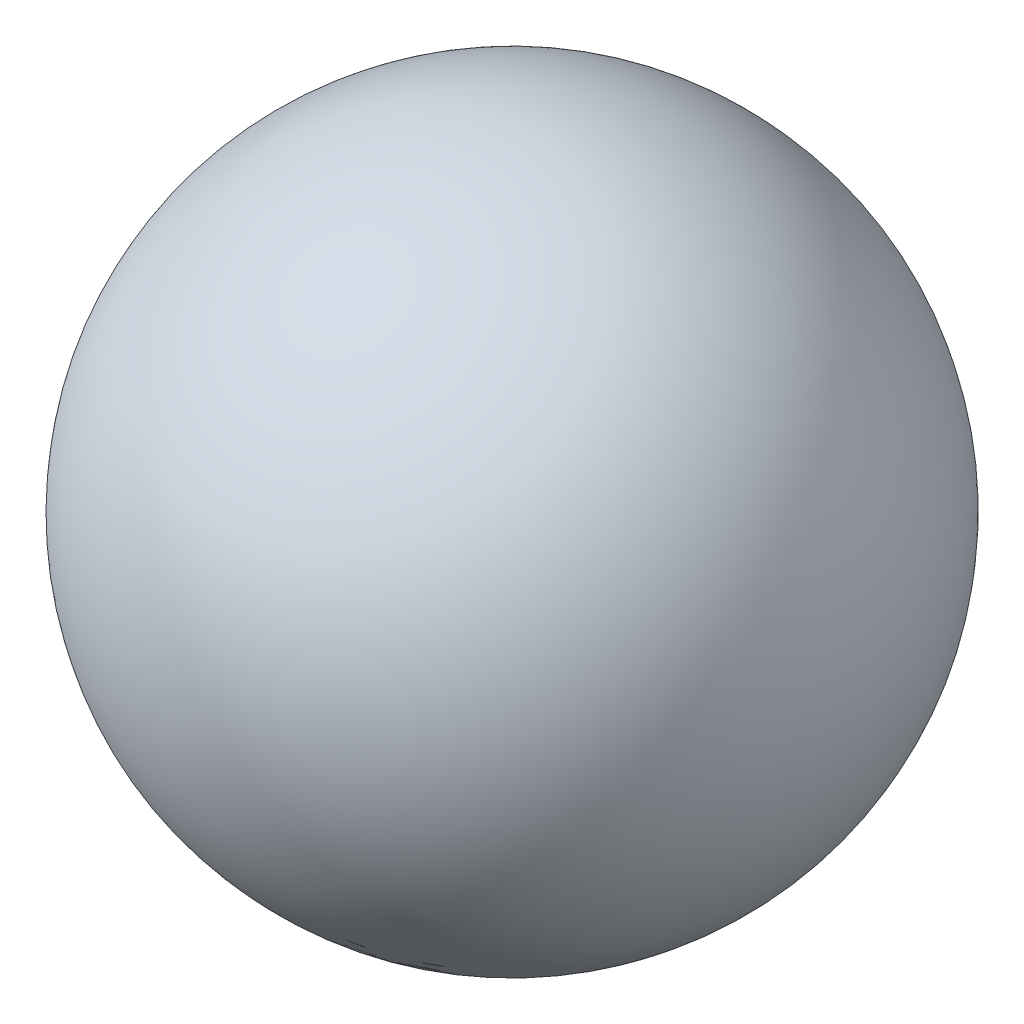
ISO-10303-21;
HEADER;
FILE_DESCRIPTION(('STEP AP214'),'2;1');
FILE_NAME('part.step','',(''),(''),'','','');
FILE_SCHEMA(('AUTOMOTIVE_DESIGN { 1 0 10303 214 1 1 1 1 }'));
ENDSEC;
DATA;
#1=APPLICATION_CONTEXT('core data for automotive mechanical design processes');
#2=APPLICATION_PROTOCOL_DEFINITION('international standard','automotive_design',2000,#1);
#3=PRODUCT_CONTEXT('',#1,'mechanical');
#4=PRODUCT('Part','Part','',(#3));
#5=PRODUCT_RELATED_PRODUCT_CATEGORY('part','',(#4));
#6=PRODUCT_DEFINITION_FORMATION('','',#4);
#7=PRODUCT_DEFINITION_CONTEXT('part definition',#1,'design');
#8=PRODUCT_DEFINITION('design','',#6,#7);
#9=PRODUCT_DEFINITION_SHAPE('','',#8);
#10=(LENGTH_UNIT() NAMED_UNIT(*) SI_UNIT(.MILLI.,.METRE.));
#11=(NAMED_UNIT(*) PLANE_ANGLE_UNIT() SI_UNIT($,.RADIAN.));
#12=(NAMED_UNIT(*) SI_UNIT($,.STERADIAN.) SOLID_ANGLE_UNIT());
#13=UNCERTAINTY_MEASURE_WITH_UNIT(LENGTH_MEASURE(1.E-05),#10,'distance_accuracy_value','');
#14=(GEOMETRIC_REPRESENTATION_CONTEXT(3) GLOBAL_UNCERTAINTY_ASSIGNED_CONTEXT((#13)) GLOBAL_UNIT_ASSIGNED_CONTEXT((#10,
#11,#12)) REPRESENTATION_CONTEXT('',''));
#15=CARTESIAN_POINT('',(0.,0.,0.));
#16=DIRECTION('',(0.,0.,1.));
#17=DIRECTION('',(1.,0.,0.));
#18=AXIS2_PLACEMENT_3D('',#15,#16,#17);
#19=CARTESIAN_POINT('',(0.,0.,0.));
#20=DIRECTION('',(0.619071263989437,0.440769125939556,0.649979497923589));
#21=DIRECTION('',(0.11363298721974,-0.869210976273878,0.481206632269891));
#22=AXIS2_PLACEMENT_3D('',#19,#20,#21);
#23=SPHERICAL_SURFACE('',#22,0.794);
#24=CARTESIAN_POINT('',(0.491542583607612,0.349970685996007,0.51608372135133));
#25=VERTEX_POINT('',#24);
#26=VERTEX_LOOP('',#25);
#27=FACE_BOUND('',#26,.T.);
#28=CARTESIAN_POINT('',(-0.491542583607614,-0.349970685996007,-0.51608372135133));
#29=VERTEX_POINT('',#28);
#30=VERTEX_LOOP('',#29);
#31=FACE_BOUND('',#30,.T.);
#32=ADVANCED_FACE('F15',(#27,#31),#23,.T.);
#33=CLOSED_SHELL('',(#32));
#34=MANIFOLD_SOLID_BREP('B1',#33);
#35=ADVANCED_BREP_SHAPE_REPRESENTATION('',(#18,#34),#14);
#36=SHAPE_DEFINITION_REPRESENTATION(#9,#35);
ENDSEC;
END-ISO-10303-21;
